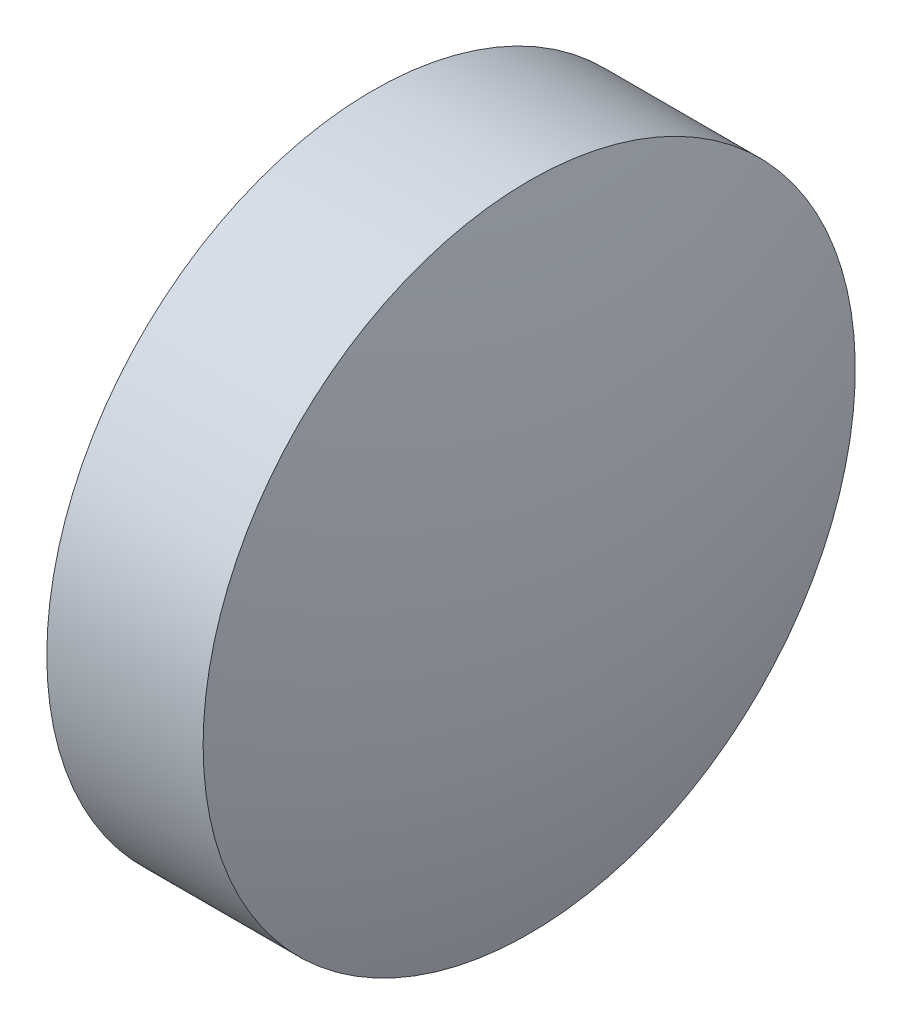
ISO-10303-21;
HEADER;
FILE_DESCRIPTION(('STEP AP214'),'2;1');
FILE_NAME('part.step','',(''),(''),'','','');
FILE_SCHEMA(('AUTOMOTIVE_DESIGN { 1 0 10303 214 1 1 1 1 }'));
ENDSEC;
DATA;
#1=APPLICATION_CONTEXT('core data for automotive mechanical design processes');
#2=APPLICATION_PROTOCOL_DEFINITION('international standard','automotive_design',2000,#1);
#3=PRODUCT_CONTEXT('',#1,'mechanical');
#4=PRODUCT('Part','Part','',(#3));
#5=PRODUCT_RELATED_PRODUCT_CATEGORY('part','',(#4));
#6=PRODUCT_DEFINITION_FORMATION('','',#4);
#7=PRODUCT_DEFINITION_CONTEXT('part definition',#1,'design');
#8=PRODUCT_DEFINITION('design','',#6,#7);
#9=PRODUCT_DEFINITION_SHAPE('','',#8);
#10=(LENGTH_UNIT() NAMED_UNIT(*) SI_UNIT(.MILLI.,.METRE.));
#11=(NAMED_UNIT(*) PLANE_ANGLE_UNIT() SI_UNIT($,.RADIAN.));
#12=(NAMED_UNIT(*) SI_UNIT($,.STERADIAN.) SOLID_ANGLE_UNIT());
#13=UNCERTAINTY_MEASURE_WITH_UNIT(LENGTH_MEASURE(1.E-05),#10,'distance_accuracy_value','');
#14=(GEOMETRIC_REPRESENTATION_CONTEXT(3) GLOBAL_UNCERTAINTY_ASSIGNED_CONTEXT((#13)) GLOBAL_UNIT_ASSIGNED_CONTEXT((#10,
#11,#12)) REPRESENTATION_CONTEXT('',''));
#15=CARTESIAN_POINT('',(0.,0.,0.));
#16=DIRECTION('',(0.,0.,1.));
#17=DIRECTION('',(1.,0.,0.));
#18=AXIS2_PLACEMENT_3D('',#15,#16,#17);
#19=CARTESIAN_POINT('',(489.21659413839,112.78888201552,0.));
#20=DIRECTION('',(-1.,0.,0.));
#21=DIRECTION('',(0.,1.,0.));
#22=AXIS2_PLACEMENT_3D('',#19,#20,#21);
#23=SPHERICAL_SURFACE('',#22,10.37);
#24=CARTESIAN_POINT('',(499.09659413839,112.78888201552,0.));
#25=DIRECTION('',(-1.,0.,0.));
#26=DIRECTION('',(0.,0.,1.));
#27=AXIS2_PLACEMENT_3D('',#24,#25,#26);
#28=CIRCLE('',#27,3.15);
#29=CARTESIAN_POINT('',(499.09659413839,112.78888201552,3.15));
#30=VERTEX_POINT('',#29);
#31=EDGE_CURVE('E10',#30,#30,#28,.T.);
#32=ORIENTED_EDGE('',*,*,#31,.F.);
#33=EDGE_LOOP('',(#32));
#34=FACE_BOUND('',#33,.T.);
#35=ADVANCED_FACE('F35',(#34),#23,.T.);
#36=CARTESIAN_POINT('',(479.10001430245,112.78888201552,0.));
#37=DIRECTION('',(-1.,0.,0.));
#38=DIRECTION('',(0.,0.,1.));
#39=AXIS2_PLACEMENT_3D('',#36,#37,#38);
#40=CYLINDRICAL_SURFACE('',#39,3.15);
#41=CARTESIAN_POINT('',(497.58659413839,112.78888201552,0.));
#42=DIRECTION('',(-1.,0.,0.));
#43=DIRECTION('',(0.,0.,1.));
#44=AXIS2_PLACEMENT_3D('',#41,#42,#43);
#45=CIRCLE('',#44,3.15);
#46=CARTESIAN_POINT('',(497.58659413839,112.78888201552,3.15));
#47=VERTEX_POINT('',#46);
#48=EDGE_CURVE('E41',#47,#47,#45,.T.);
#49=ORIENTED_EDGE('',*,*,#48,.F.);
#50=EDGE_LOOP('',(#49));
#51=FACE_BOUND('',#50,.T.);
#52=ORIENTED_EDGE('',*,*,#31,.T.);
#53=EDGE_LOOP('',(#52));
#54=FACE_BOUND('',#53,.T.);
#55=ADVANCED_FACE('F49',(#51,#54),#40,.T.);
#56=CARTESIAN_POINT('',(497.58659413839,112.78888201552,0.));
#57=DIRECTION('',(1.,0.,0.));
#58=DIRECTION('',(0.,0.,-1.));
#59=AXIS2_PLACEMENT_3D('',#56,#57,#58);
#60=PLANE('',#59);
#61=ORIENTED_EDGE('',*,*,#48,.T.);
#62=EDGE_LOOP('',(#61));
#63=FACE_BOUND('',#62,.T.);
#64=ADVANCED_FACE('F47',(#63),#60,.F.);
#65=CLOSED_SHELL('',(#35,#55,#64));
#66=MANIFOLD_SOLID_BREP('B2',#65);
#67=ADVANCED_BREP_SHAPE_REPRESENTATION('',(#18,#66),#14);
#68=SHAPE_DEFINITION_REPRESENTATION(#9,#67);
ENDSEC;
END-ISO-10303-21;
